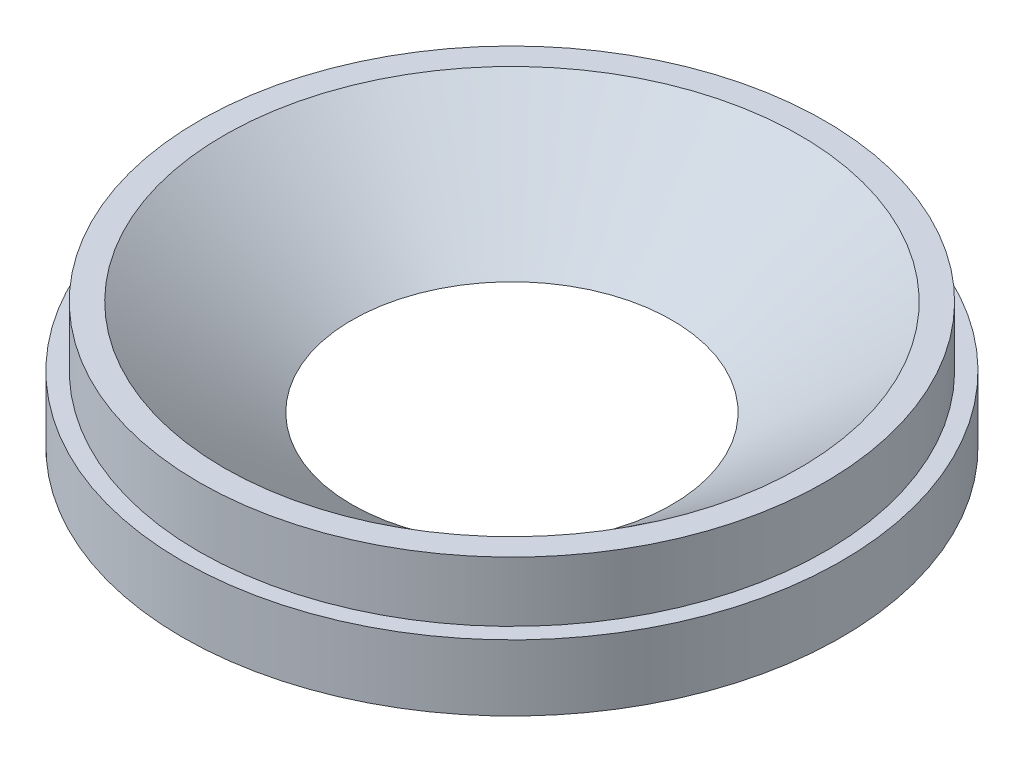
ISO-10303-21;
HEADER;
FILE_DESCRIPTION(('STEP AP214'),'2;1');
FILE_NAME('part.step','',(''),(''),'','','');
FILE_SCHEMA(('AUTOMOTIVE_DESIGN { 1 0 10303 214 1 1 1 1 }'));
ENDSEC;
DATA;
#1=APPLICATION_CONTEXT('core data for automotive mechanical design processes');
#2=APPLICATION_PROTOCOL_DEFINITION('international standard','automotive_design',2000,#1);
#3=PRODUCT_CONTEXT('',#1,'mechanical');
#4=PRODUCT('Part','Part','',(#3));
#5=PRODUCT_RELATED_PRODUCT_CATEGORY('part','',(#4));
#6=PRODUCT_DEFINITION_FORMATION('','',#4);
#7=PRODUCT_DEFINITION_CONTEXT('part definition',#1,'design');
#8=PRODUCT_DEFINITION('design','',#6,#7);
#9=PRODUCT_DEFINITION_SHAPE('','',#8);
#10=(LENGTH_UNIT() NAMED_UNIT(*) SI_UNIT(.MILLI.,.METRE.));
#11=(NAMED_UNIT(*) PLANE_ANGLE_UNIT() SI_UNIT($,.RADIAN.));
#12=(NAMED_UNIT(*) SI_UNIT($,.STERADIAN.) SOLID_ANGLE_UNIT());
#13=UNCERTAINTY_MEASURE_WITH_UNIT(LENGTH_MEASURE(1.E-05),#10,'distance_accuracy_value','');
#14=(GEOMETRIC_REPRESENTATION_CONTEXT(3) GLOBAL_UNCERTAINTY_ASSIGNED_CONTEXT((#13)) GLOBAL_UNIT_ASSIGNED_CONTEXT((#10,
#11,#12)) REPRESENTATION_CONTEXT('',''));
#15=CARTESIAN_POINT('',(0.,0.,0.));
#16=DIRECTION('',(0.,0.,1.));
#17=DIRECTION('',(1.,0.,0.));
#18=AXIS2_PLACEMENT_3D('',#15,#16,#17);
#19=CARTESIAN_POINT('',(0.,28.5740475,0.));
#20=DIRECTION('',(0.,1.,0.));
#21=DIRECTION('',(0.,0.,1.));
#22=AXIS2_PLACEMENT_3D('',#19,#20,#21);
#23=CYLINDRICAL_SURFACE('',#22,25.4);
#24=CARTESIAN_POINT('',(0.,0.,0.));
#25=DIRECTION('',(0.,1.,0.));
#26=DIRECTION('',(0.,0.,1.));
#27=AXIS2_PLACEMENT_3D('',#24,#25,#26);
#28=CIRCLE('',#27,25.4);
#29=CARTESIAN_POINT('',(0.,0.,25.4));
#30=VERTEX_POINT('',#29);
#31=EDGE_CURVE('E64',#30,#30,#28,.T.);
#32=ORIENTED_EDGE('',*,*,#31,.T.);
#33=EDGE_LOOP('',(#32));
#34=FACE_BOUND('',#33,.T.);
#35=CARTESIAN_POINT('',(0.,-3.175,0.));
#36=DIRECTION('',(0.,1.,0.));
#37=DIRECTION('',(0.,0.,1.));
#38=AXIS2_PLACEMENT_3D('',#35,#36,#37);
#39=CIRCLE('',#38,25.4);
#40=CARTESIAN_POINT('',(0.,-3.175,25.4));
#41=VERTEX_POINT('',#40);
#42=EDGE_CURVE('E10',#41,#41,#39,.T.);
#43=ORIENTED_EDGE('',*,*,#42,.F.);
#44=EDGE_LOOP('',(#43));
#45=FACE_BOUND('',#44,.T.);
#46=ADVANCED_FACE('F36',(#34,#45),#23,.F.);
#47=CARTESIAN_POINT('',(-34.8996,-3.175,0.));
#48=DIRECTION('',(0.,-1.,0.));
#49=DIRECTION('',(0.,0.,-1.));
#50=AXIS2_PLACEMENT_3D('',#47,#48,#49);
#51=PLANE('',#50);
#52=ORIENTED_EDGE('',*,*,#42,.T.);
#53=EDGE_LOOP('',(#52));
#54=FACE_BOUND('',#53,.T.);
#55=CARTESIAN_POINT('',(0.,-3.175,0.));
#56=DIRECTION('',(0.,1.,0.));
#57=DIRECTION('',(0.,0.,1.));
#58=AXIS2_PLACEMENT_3D('',#55,#56,#57);
#59=CIRCLE('',#58,34.8996);
#60=CARTESIAN_POINT('',(0.,-3.175,34.8996));
#61=VERTEX_POINT('',#60);
#62=EDGE_CURVE('E42',#61,#61,#59,.T.);
#63=ORIENTED_EDGE('',*,*,#62,.F.);
#64=EDGE_LOOP('',(#63));
#65=FACE_BOUND('',#64,.T.);
#66=ADVANCED_FACE('F82',(#54,#65),#51,.T.);
#67=CARTESIAN_POINT('',(0.,28.5740475,0.));
#68=DIRECTION('',(0.,1.,0.));
#69=DIRECTION('',(0.,0.,1.));
#70=AXIS2_PLACEMENT_3D('',#67,#68,#69);
#71=CYLINDRICAL_SURFACE('',#70,34.8996);
#72=ORIENTED_EDGE('',*,*,#62,.T.);
#73=EDGE_LOOP('',(#72));
#74=FACE_BOUND('',#73,.T.);
#75=CARTESIAN_POINT('',(0.,3.80999999999999,0.));
#76=DIRECTION('',(0.,1.,0.));
#77=DIRECTION('',(0.,0.,1.));
#78=AXIS2_PLACEMENT_3D('',#75,#76,#77);
#79=CIRCLE('',#78,34.8996);
#80=CARTESIAN_POINT('',(0.,3.80999999999999,34.8996));
#81=VERTEX_POINT('',#80);
#82=EDGE_CURVE('E46',#81,#81,#79,.T.);
#83=ORIENTED_EDGE('',*,*,#82,.F.);
#84=EDGE_LOOP('',(#83));
#85=FACE_BOUND('',#84,.T.);
#86=ADVANCED_FACE('F86',(#74,#85),#71,.T.);
#87=CARTESIAN_POINT('',(-33.147,3.80999999999999,0.));
#88=DIRECTION('',(0.,1.,0.));
#89=DIRECTION('',(0.,0.,1.));
#90=AXIS2_PLACEMENT_3D('',#87,#88,#89);
#91=PLANE('',#90);
#92=ORIENTED_EDGE('',*,*,#82,.T.);
#93=EDGE_LOOP('',(#92));
#94=FACE_BOUND('',#93,.T.);
#95=CARTESIAN_POINT('',(0.,3.80999999999999,0.));
#96=DIRECTION('',(0.,1.,0.));
#97=DIRECTION('',(0.,0.,1.));
#98=AXIS2_PLACEMENT_3D('',#95,#96,#97);
#99=CIRCLE('',#98,33.147);
#100=CARTESIAN_POINT('',(0.,3.80999999999999,33.147));
#101=VERTEX_POINT('',#100);
#102=EDGE_CURVE('E50',#101,#101,#99,.T.);
#103=ORIENTED_EDGE('',*,*,#102,.F.);
#104=EDGE_LOOP('',(#103));
#105=FACE_BOUND('',#104,.T.);
#106=ADVANCED_FACE('F90',(#94,#105),#91,.T.);
#107=CARTESIAN_POINT('',(0.,28.5740475,0.));
#108=DIRECTION('',(0.,1.,0.));
#109=DIRECTION('',(0.,0.,1.));
#110=AXIS2_PLACEMENT_3D('',#107,#108,#109);
#111=CYLINDRICAL_SURFACE('',#110,33.147);
#112=ORIENTED_EDGE('',*,*,#102,.T.);
#113=EDGE_LOOP('',(#112));
#114=FACE_BOUND('',#113,.T.);
#115=CARTESIAN_POINT('',(0.,10.16,0.));
#116=DIRECTION('',(0.,1.,0.));
#117=DIRECTION('',(0.,0.,1.));
#118=AXIS2_PLACEMENT_3D('',#115,#116,#117);
#119=CIRCLE('',#118,33.147);
#120=CARTESIAN_POINT('',(0.,10.16,33.147));
#121=VERTEX_POINT('',#120);
#122=EDGE_CURVE('E55',#121,#121,#119,.T.);
#123=ORIENTED_EDGE('',*,*,#122,.F.);
#124=EDGE_LOOP('',(#123));
#125=FACE_BOUND('',#124,.T.);
#126=ADVANCED_FACE('F96',(#114,#125),#111,.T.);
#127=CARTESIAN_POINT('',(-33.147,10.16,0.));
#128=DIRECTION('',(0.,1.,0.));
#129=DIRECTION('',(0.,0.,1.));
#130=AXIS2_PLACEMENT_3D('',#127,#128,#129);
#131=PLANE('',#130);
#132=ORIENTED_EDGE('',*,*,#122,.T.);
#133=EDGE_LOOP('',(#132));
#134=FACE_BOUND('',#133,.T.);
#135=CARTESIAN_POINT('',(0.,10.16,0.));
#136=DIRECTION('',(0.,1.,0.));
#137=DIRECTION('',(0.,0.,1.));
#138=AXIS2_PLACEMENT_3D('',#135,#136,#137);
#139=CIRCLE('',#138,30.4943248836102);
#140=CARTESIAN_POINT('',(0.,10.16,30.4943248836102));
#141=VERTEX_POINT('',#140);
#142=EDGE_CURVE('E58',#141,#141,#139,.T.);
#143=ORIENTED_EDGE('',*,*,#142,.F.);
#144=EDGE_LOOP('',(#143));
#145=FACE_BOUND('',#144,.T.);
#146=ADVANCED_FACE('F78',(#134,#145),#131,.T.);
#147=CARTESIAN_POINT('',(0.,0.,0.));
#148=DIRECTION('',(0.,1.,0.));
#149=DIRECTION('',(0.,0.,1.));
#150=AXIS2_PLACEMENT_3D('',#147,#148,#149);
#151=CONICAL_SURFACE('',#150,16.9378526788586,0.927642497434981);
#152=ORIENTED_EDGE('',*,*,#142,.T.);
#153=EDGE_LOOP('',(#152));
#154=FACE_BOUND('',#153,.T.);
#155=CARTESIAN_POINT('',(0.,0.,0.));
#156=DIRECTION('',(0.,1.,0.));
#157=DIRECTION('',(0.,0.,1.));
#158=AXIS2_PLACEMENT_3D('',#155,#156,#157);
#159=CIRCLE('',#158,16.9378526788586);
#160=CARTESIAN_POINT('',(0.,0.,16.9378526788586));
#161=VERTEX_POINT('',#160);
#162=EDGE_CURVE('E61',#161,#161,#159,.T.);
#163=ORIENTED_EDGE('',*,*,#162,.F.);
#164=EDGE_LOOP('',(#163));
#165=FACE_BOUND('',#164,.T.);
#166=ADVANCED_FACE('F72',(#154,#165),#151,.F.);
#167=CARTESIAN_POINT('',(-25.4,0.,0.));
#168=DIRECTION('',(0.,-1.,0.));
#169=DIRECTION('',(0.,0.,-1.));
#170=AXIS2_PLACEMENT_3D('',#167,#168,#169);
#171=PLANE('',#170);
#172=ORIENTED_EDGE('',*,*,#162,.T.);
#173=EDGE_LOOP('',(#172));
#174=FACE_BOUND('',#173,.T.);
#175=ORIENTED_EDGE('',*,*,#31,.F.);
#176=EDGE_LOOP('',(#175));
#177=FACE_BOUND('',#176,.T.);
#178=ADVANCED_FACE('F70',(#174,#177),#171,.T.);
#179=CLOSED_SHELL('',(#46,#66,#86,#106,#126,#146,#166,#178));
#180=MANIFOLD_SOLID_BREP('B2',#179);
#181=ADVANCED_BREP_SHAPE_REPRESENTATION('',(#18,#180),#14);
#182=SHAPE_DEFINITION_REPRESENTATION(#9,#181);
ENDSEC;
END-ISO-10303-21;
